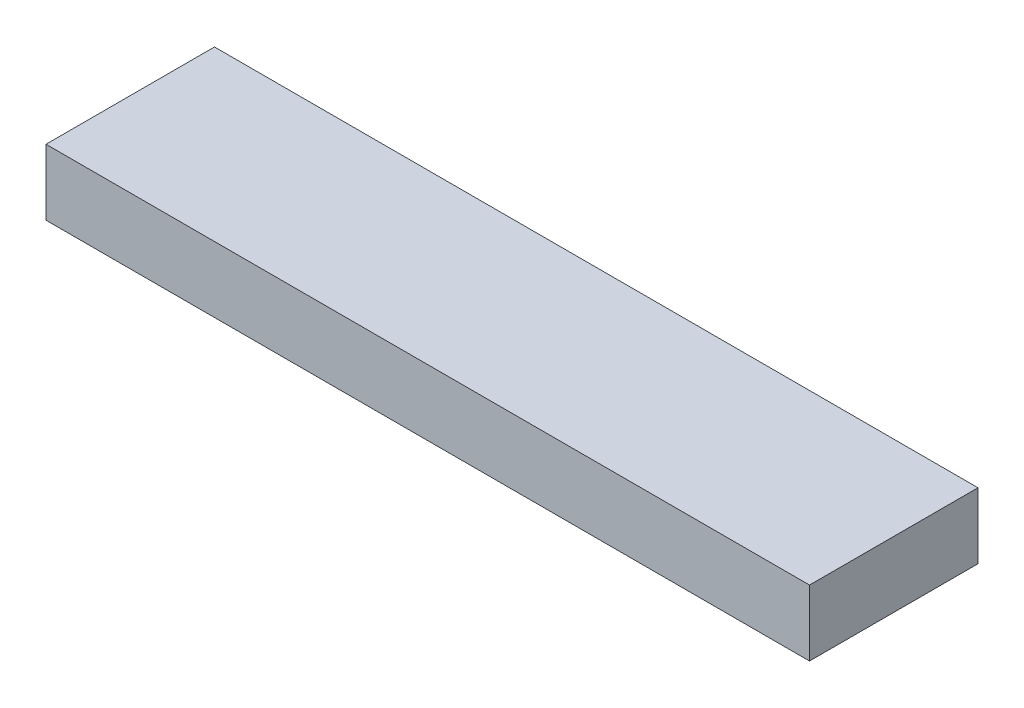
ISO-10303-21;
HEADER;
FILE_DESCRIPTION(('STEP AP214'),'2;1');
FILE_NAME('part.step','',(''),(''),'','','');
FILE_SCHEMA(('AUTOMOTIVE_DESIGN { 1 0 10303 214 1 1 1 1 }'));
ENDSEC;
DATA;
#1=APPLICATION_CONTEXT('core data for automotive mechanical design processes');
#2=APPLICATION_PROTOCOL_DEFINITION('international standard','automotive_design',2000,#1);
#3=PRODUCT_CONTEXT('',#1,'mechanical');
#4=PRODUCT('Part','Part','',(#3));
#5=PRODUCT_RELATED_PRODUCT_CATEGORY('part','',(#4));
#6=PRODUCT_DEFINITION_FORMATION('','',#4);
#7=PRODUCT_DEFINITION_CONTEXT('part definition',#1,'design');
#8=PRODUCT_DEFINITION('design','',#6,#7);
#9=PRODUCT_DEFINITION_SHAPE('','',#8);
#10=(LENGTH_UNIT() NAMED_UNIT(*) SI_UNIT(.MILLI.,.METRE.));
#11=(NAMED_UNIT(*) PLANE_ANGLE_UNIT() SI_UNIT($,.RADIAN.));
#12=(NAMED_UNIT(*) SI_UNIT($,.STERADIAN.) SOLID_ANGLE_UNIT());
#13=UNCERTAINTY_MEASURE_WITH_UNIT(LENGTH_MEASURE(1.E-05),#10,'distance_accuracy_value','');
#14=(GEOMETRIC_REPRESENTATION_CONTEXT(3) GLOBAL_UNCERTAINTY_ASSIGNED_CONTEXT((#13)) GLOBAL_UNIT_ASSIGNED_CONTEXT((#10,
#11,#12)) REPRESENTATION_CONTEXT('',''));
#15=CARTESIAN_POINT('',(0.,0.,0.));
#16=DIRECTION('',(0.,0.,1.));
#17=DIRECTION('',(1.,0.,0.));
#18=AXIS2_PLACEMENT_3D('',#15,#16,#17);
#19=CARTESIAN_POINT('',(145.,-25.,32.));
#20=DIRECTION('',(1.,0.,0.));
#21=DIRECTION('',(0.,0.,-1.));
#22=AXIS2_PLACEMENT_3D('',#19,#20,#21);
#23=PLANE('',#22);
#24=DIRECTION('',(0.,0.,-1.));
#25=VECTOR('',#24,1.);
#26=CARTESIAN_POINT('',(145.,0.,32.));
#27=LINE('',#26,#25);
#28=CARTESIAN_POINT('',(145.,0.,32.));
#29=VERTEX_POINT('',#28);
#30=CARTESIAN_POINT('',(145.,0.,-32.));
#31=VERTEX_POINT('',#30);
#32=EDGE_CURVE('E97',#29,#31,#27,.T.);
#33=ORIENTED_EDGE('',*,*,#32,.F.);
#34=DIRECTION('',(0.,1.,0.));
#35=VECTOR('',#34,1.);
#36=CARTESIAN_POINT('',(145.,-25.,32.));
#37=LINE('',#36,#35);
#38=CARTESIAN_POINT('',(145.,-25.,32.));
#39=VERTEX_POINT('',#38);
#40=EDGE_CURVE('E11',#39,#29,#37,.T.);
#41=ORIENTED_EDGE('',*,*,#40,.F.);
#42=DIRECTION('',(0.,0.,-1.));
#43=VECTOR('',#42,1.);
#44=CARTESIAN_POINT('',(145.,-25.,32.));
#45=LINE('',#44,#43);
#46=CARTESIAN_POINT('',(145.,-25.,-32.));
#47=VERTEX_POINT('',#46);
#48=EDGE_CURVE('E91',#39,#47,#45,.T.);
#49=ORIENTED_EDGE('',*,*,#48,.T.);
#50=DIRECTION('',(0.,1.,0.));
#51=VECTOR('',#50,1.);
#52=CARTESIAN_POINT('',(145.,-25.,-32.));
#53=LINE('',#52,#51);
#54=EDGE_CURVE('E36',#47,#31,#53,.T.);
#55=ORIENTED_EDGE('',*,*,#54,.T.);
#56=EDGE_LOOP('',(#33,#41,#49,#55));
#57=FACE_BOUND('',#56,.T.);
#58=ADVANCED_FACE('F33',(#57),#23,.T.);
#59=CARTESIAN_POINT('',(-145.,-25.,32.));
#60=DIRECTION('',(0.,0.,1.));
#61=DIRECTION('',(1.,0.,0.));
#62=AXIS2_PLACEMENT_3D('',#59,#60,#61);
#63=PLANE('',#62);
#64=DIRECTION('',(1.,0.,0.));
#65=VECTOR('',#64,1.);
#66=CARTESIAN_POINT('',(-145.,0.,32.));
#67=LINE('',#66,#65);
#68=CARTESIAN_POINT('',(-145.,0.,32.));
#69=VERTEX_POINT('',#68);
#70=EDGE_CURVE('E93',#69,#29,#67,.T.);
#71=ORIENTED_EDGE('',*,*,#70,.F.);
#72=DIRECTION('',(0.,1.,0.));
#73=VECTOR('',#72,1.);
#74=CARTESIAN_POINT('',(-145.,-25.,32.));
#75=LINE('',#74,#73);
#76=CARTESIAN_POINT('',(-145.,-25.,32.));
#77=VERTEX_POINT('',#76);
#78=EDGE_CURVE('E42',#77,#69,#75,.T.);
#79=ORIENTED_EDGE('',*,*,#78,.F.);
#80=DIRECTION('',(1.,0.,0.));
#81=VECTOR('',#80,1.);
#82=CARTESIAN_POINT('',(-145.,-25.,32.));
#83=LINE('',#82,#81);
#84=EDGE_CURVE('E88',#77,#39,#83,.T.);
#85=ORIENTED_EDGE('',*,*,#84,.T.);
#86=ORIENTED_EDGE('',*,*,#40,.T.);
#87=EDGE_LOOP('',(#71,#79,#85,#86));
#88=FACE_BOUND('',#87,.T.);
#89=ADVANCED_FACE('F107',(#88),#63,.T.);
#90=CARTESIAN_POINT('',(-145.,-25.,32.));
#91=DIRECTION('',(-1.,0.,0.));
#92=DIRECTION('',(0.,0.,1.));
#93=AXIS2_PLACEMENT_3D('',#90,#91,#92);
#94=PLANE('',#93);
#95=DIRECTION('',(0.,0.,1.));
#96=VECTOR('',#95,1.);
#97=CARTESIAN_POINT('',(-145.,0.,32.));
#98=LINE('',#97,#96);
#99=CARTESIAN_POINT('',(-145.,0.,-32.));
#100=VERTEX_POINT('',#99);
#101=EDGE_CURVE('E83',#100,#69,#98,.T.);
#102=ORIENTED_EDGE('',*,*,#101,.F.);
#103=DIRECTION('',(0.,1.,0.));
#104=VECTOR('',#103,1.);
#105=CARTESIAN_POINT('',(-145.,-25.,-32.));
#106=LINE('',#105,#104);
#107=CARTESIAN_POINT('',(-145.,-25.,-32.));
#108=VERTEX_POINT('',#107);
#109=EDGE_CURVE('E78',#108,#100,#106,.T.);
#110=ORIENTED_EDGE('',*,*,#109,.F.);
#111=DIRECTION('',(0.,0.,1.));
#112=VECTOR('',#111,1.);
#113=CARTESIAN_POINT('',(-145.,-25.,32.));
#114=LINE('',#113,#112);
#115=EDGE_CURVE('E81',#108,#77,#114,.T.);
#116=ORIENTED_EDGE('',*,*,#115,.T.);
#117=ORIENTED_EDGE('',*,*,#78,.T.);
#118=EDGE_LOOP('',(#102,#110,#116,#117));
#119=FACE_BOUND('',#118,.T.);
#120=ADVANCED_FACE('F80',(#119),#94,.T.);
#121=CARTESIAN_POINT('',(-145.,-25.,-32.));
#122=DIRECTION('',(0.,0.,-1.));
#123=DIRECTION('',(-1.,0.,0.));
#124=AXIS2_PLACEMENT_3D('',#121,#122,#123);
#125=PLANE('',#124);
#126=DIRECTION('',(-1.,0.,0.));
#127=VECTOR('',#126,1.);
#128=CARTESIAN_POINT('',(-145.,0.,-32.));
#129=LINE('',#128,#127);
#130=EDGE_CURVE('E100',#31,#100,#129,.T.);
#131=ORIENTED_EDGE('',*,*,#130,.F.);
#132=ORIENTED_EDGE('',*,*,#54,.F.);
#133=DIRECTION('',(-1.,0.,0.));
#134=VECTOR('',#133,1.);
#135=CARTESIAN_POINT('',(-145.,-25.,-32.));
#136=LINE('',#135,#134);
#137=EDGE_CURVE('E87',#47,#108,#136,.T.);
#138=ORIENTED_EDGE('',*,*,#137,.T.);
#139=ORIENTED_EDGE('',*,*,#109,.T.);
#140=EDGE_LOOP('',(#131,#132,#138,#139));
#141=FACE_BOUND('',#140,.T.);
#142=ADVANCED_FACE('F90',(#141),#125,.T.);
#143=CARTESIAN_POINT('',(0.,-25.,0.));
#144=DIRECTION('',(0.,-1.,0.));
#145=DIRECTION('',(0.,0.,-1.));
#146=AXIS2_PLACEMENT_3D('',#143,#144,#145);
#147=PLANE('',#146);
#148=ORIENTED_EDGE('',*,*,#48,.F.);
#149=ORIENTED_EDGE('',*,*,#84,.F.);
#150=ORIENTED_EDGE('',*,*,#115,.F.);
#151=ORIENTED_EDGE('',*,*,#137,.F.);
#152=EDGE_LOOP('',(#148,#149,#150,#151));
#153=FACE_BOUND('',#152,.T.);
#154=ADVANCED_FACE('F86',(#153),#147,.T.);
#155=CARTESIAN_POINT('',(0.,0.,0.));
#156=DIRECTION('',(0.,-1.,0.));
#157=DIRECTION('',(0.,0.,-1.));
#158=AXIS2_PLACEMENT_3D('',#155,#156,#157);
#159=PLANE('',#158);
#160=ORIENTED_EDGE('',*,*,#32,.T.);
#161=ORIENTED_EDGE('',*,*,#130,.T.);
#162=ORIENTED_EDGE('',*,*,#101,.T.);
#163=ORIENTED_EDGE('',*,*,#70,.T.);
#164=EDGE_LOOP('',(#160,#161,#162,#163));
#165=FACE_BOUND('',#164,.T.);
#166=ADVANCED_FACE('F106',(#165),#159,.F.);
#167=CLOSED_SHELL('',(#58,#89,#120,#142,#154,#166));
#168=MANIFOLD_SOLID_BREP('B2',#167);
#169=ADVANCED_BREP_SHAPE_REPRESENTATION('',(#18,#168),#14);
#170=SHAPE_DEFINITION_REPRESENTATION(#9,#169);
ENDSEC;
END-ISO-10303-21;
